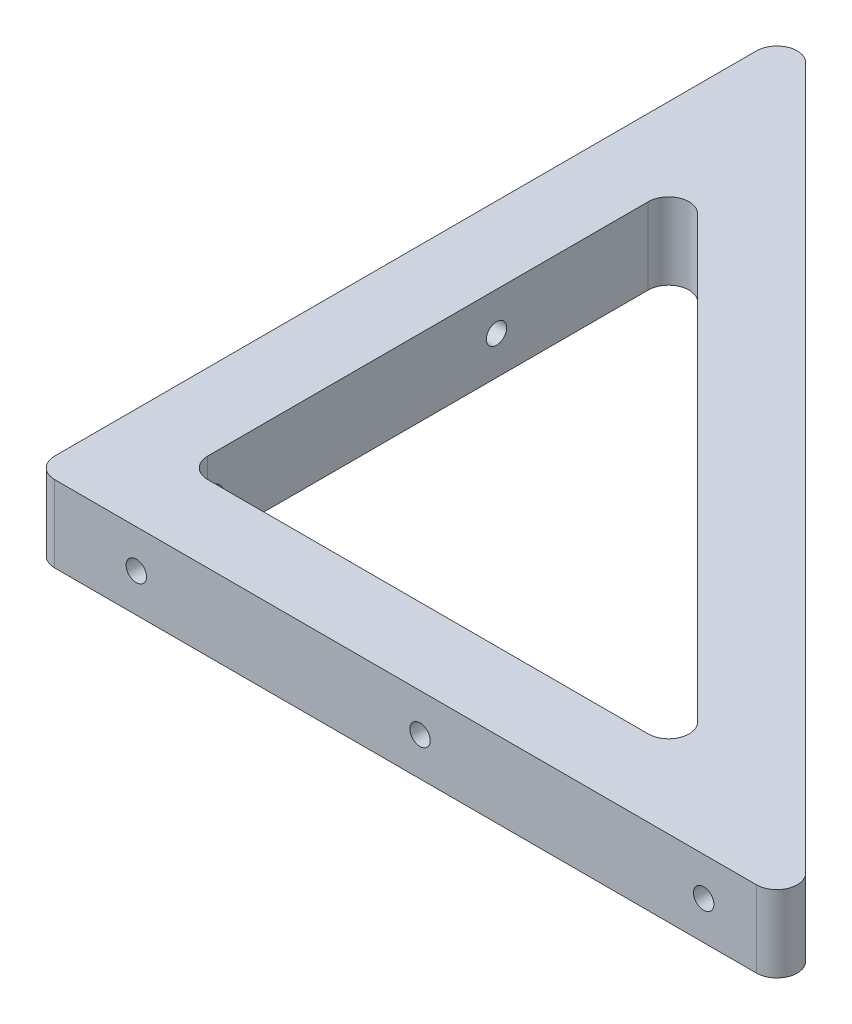
ISO-10303-21;
HEADER;
FILE_DESCRIPTION(('STEP AP214'),'2;1');
FILE_NAME('part.step','',(''),(''),'','','');
FILE_SCHEMA(('AUTOMOTIVE_DESIGN { 1 0 10303 214 1 1 1 1 }'));
ENDSEC;
DATA;
#1=APPLICATION_CONTEXT('core data for automotive mechanical design processes');
#2=APPLICATION_PROTOCOL_DEFINITION('international standard','automotive_design',2000,#1);
#3=PRODUCT_CONTEXT('',#1,'mechanical');
#4=PRODUCT('Part','Part','',(#3));
#5=PRODUCT_RELATED_PRODUCT_CATEGORY('part','',(#4));
#6=PRODUCT_DEFINITION_FORMATION('','',#4);
#7=PRODUCT_DEFINITION_CONTEXT('part definition',#1,'design');
#8=PRODUCT_DEFINITION('design','',#6,#7);
#9=PRODUCT_DEFINITION_SHAPE('','',#8);
#10=(LENGTH_UNIT() NAMED_UNIT(*) SI_UNIT(.MILLI.,.METRE.));
#11=(NAMED_UNIT(*) PLANE_ANGLE_UNIT() SI_UNIT($,.RADIAN.));
#12=(NAMED_UNIT(*) SI_UNIT($,.STERADIAN.) SOLID_ANGLE_UNIT());
#13=UNCERTAINTY_MEASURE_WITH_UNIT(LENGTH_MEASURE(1.E-05),#10,'distance_accuracy_value','');
#14=(GEOMETRIC_REPRESENTATION_CONTEXT(3) GLOBAL_UNCERTAINTY_ASSIGNED_CONTEXT((#13)) GLOBAL_UNIT_ASSIGNED_CONTEXT((#10,
#11,#12)) REPRESENTATION_CONTEXT('',''));
#15=CARTESIAN_POINT('',(0.,0.,0.));
#16=DIRECTION('',(0.,0.,1.));
#17=DIRECTION('',(1.,0.,0.));
#18=AXIS2_PLACEMENT_3D('',#15,#16,#17);
#19=CARTESIAN_POINT('',(38.4851920908019,4.7625,-38.4851920908019));
#20=DIRECTION('',(-0.707106781186548,0.,0.707106781186548));
#21=DIRECTION('',(0.707106781186548,0.,0.707106781186548));
#22=AXIS2_PLACEMENT_3D('',#19,#20,#21);
#23=PLANE('',#22);
#24=DIRECTION('',(-0.707106781186548,0.,-0.707106781186548));
#25=VECTOR('',#24,1.);
#26=CARTESIAN_POINT('',(38.4851920908019,4.7625,-38.4851920908019));
#27=LINE('',#26,#25);
#28=CARTESIAN_POINT('',(82.1593329573899,4.7625,5.18894877578618));
#29=VERTEX_POINT('',#28);
#30=CARTESIAN_POINT('',(-5.18894877578618,4.7625,-82.1593329573899));
#31=VERTEX_POINT('',#30);
#32=EDGE_CURVE('E386',#29,#31,#27,.T.);
#33=ORIENTED_EDGE('',*,*,#32,.F.);
#34=DIRECTION('',(0.,-1.,0.));
#35=VECTOR('',#34,1.);
#36=CARTESIAN_POINT('',(82.1593329573899,4.7625,5.18894877578616));
#37=LINE('',#36,#35);
#38=CARTESIAN_POINT('',(82.1593329573899,-4.7625,5.18894877578618));
#39=VERTEX_POINT('',#38);
#40=EDGE_CURVE('E192',#29,#39,#37,.T.);
#41=ORIENTED_EDGE('',*,*,#40,.T.);
#42=DIRECTION('',(-0.707106781186548,0.,-0.707106781186548));
#43=VECTOR('',#42,1.);
#44=CARTESIAN_POINT('',(38.4851920908019,-4.7625,-38.4851920908019));
#45=LINE('',#44,#43);
#46=CARTESIAN_POINT('',(-5.18894877578618,-4.7625,-82.1593329573899));
#47=VERTEX_POINT('',#46);
#48=EDGE_CURVE('E395',#39,#47,#45,.T.);
#49=ORIENTED_EDGE('',*,*,#48,.T.);
#50=DIRECTION('',(0.,-1.,0.));
#51=VECTOR('',#50,1.);
#52=CARTESIAN_POINT('',(-5.18894877578617,4.7625,-82.1593329573899));
#53=LINE('',#52,#51);
#54=EDGE_CURVE('E190',#47,#31,#53,.F.);
#55=ORIENTED_EDGE('',*,*,#54,.T.);
#56=EDGE_LOOP('',(#33,#41,#49,#55));
#57=FACE_BOUND('',#56,.T.);
#58=DIRECTION('',(0.,-1.,0.));
#59=VECTOR('',#58,1.);
#60=CARTESIAN_POINT('',(3.175,4.7625,-73.7953841816037));
#61=LINE('',#60,#59);
#62=CARTESIAN_POINT('',(3.175,1.26999999999999,-73.7953841816037));
#63=VERTEX_POINT('',#62);
#64=CARTESIAN_POINT('',(3.175,-1.26999999999999,-73.7953841816037));
#65=VERTEX_POINT('',#64);
#66=EDGE_CURVE('E183',#63,#65,#61,.T.);
#67=ORIENTED_EDGE('',*,*,#66,.F.);
#68=CARTESIAN_POINT('',(3.17499999999998,0.,-73.7953841816037));
#69=DIRECTION('',(-0.707106781186548,0.,0.707106781186548));
#70=DIRECTION('',(-0.707106781186548,0.,-0.707106781186548));
#71=AXIS2_PLACEMENT_3D('',#68,#69,#70);
#72=ELLIPSE('',#71,1.79605122421382,1.26999999999999);
#73=EDGE_CURVE('E377',#63,#65,#72,.T.);
#74=ORIENTED_EDGE('',*,*,#73,.T.);
#75=EDGE_LOOP('',(#67,#74));
#76=FACE_BOUND('',#75,.T.);
#77=CARTESIAN_POINT('',(73.7953841816037,0.,-3.17499999999999));
#78=DIRECTION('',(-0.707106781186548,0.,0.707106781186548));
#79=DIRECTION('',(0.707106781186548,0.,0.707106781186548));
#80=AXIS2_PLACEMENT_3D('',#77,#78,#79);
#81=ELLIPSE('',#80,1.79605122421382,1.26999999999999);
#82=CARTESIAN_POINT('',(73.7953841816037,1.26999999999999,-3.17499999999999));
#83=VERTEX_POINT('',#82);
#84=CARTESIAN_POINT('',(73.7953841816037,-1.26999999999999,-3.17499999999998));
#85=VERTEX_POINT('',#84);
#86=EDGE_CURVE('E182',#83,#85,#81,.F.);
#87=ORIENTED_EDGE('',*,*,#86,.F.);
#88=DIRECTION('',(0.,1.,0.));
#89=VECTOR('',#88,1.);
#90=CARTESIAN_POINT('',(73.7953841816037,4.7625,-3.17499999999998));
#91=LINE('',#90,#89);
#92=EDGE_CURVE('E175',#85,#83,#91,.T.);
#93=ORIENTED_EDGE('',*,*,#92,.F.);
#94=EDGE_LOOP('',(#87,#93));
#95=FACE_BOUND('',#94,.T.);
#96=ADVANCED_FACE('F53',(#57,#76,#95),#23,.F.);
#97=CARTESIAN_POINT('',(0.,4.7625,0.));
#98=DIRECTION('',(0.,-1.,0.));
#99=DIRECTION('',(0.,0.,-1.));
#100=AXIS2_PLACEMENT_3D('',#97,#98,#99);
#101=PLANE('',#100);
#102=DIRECTION('',(1.,0.,0.));
#103=VECTOR('',#102,1.);
#104=CARTESIAN_POINT('',(0.,4.7625,9.525));
#105=LINE('',#104,#103);
#106=CARTESIAN_POINT('',(-6.985,4.7625,9.525));
#107=VERTEX_POINT('',#106);
#108=CARTESIAN_POINT('',(80.3632817331761,4.7625,9.525));
#109=VERTEX_POINT('',#108);
#110=EDGE_CURVE('E383',#107,#109,#105,.T.);
#111=ORIENTED_EDGE('',*,*,#110,.T.);
#112=CARTESIAN_POINT('',(80.3632817331761,4.7625,6.985));
#113=DIRECTION('',(0.,-1.,0.));
#114=DIRECTION('',(0.,0.,-1.));
#115=AXIS2_PLACEMENT_3D('',#112,#113,#114);
#116=CIRCLE('',#115,2.54);
#117=EDGE_CURVE('E213',#109,#29,#116,.F.);
#118=ORIENTED_EDGE('',*,*,#117,.T.);
#119=ORIENTED_EDGE('',*,*,#32,.T.);
#120=CARTESIAN_POINT('',(-6.985,4.7625,-80.3632817331761));
#121=DIRECTION('',(0.,-1.,0.));
#122=DIRECTION('',(0.,0.,-1.));
#123=AXIS2_PLACEMENT_3D('',#120,#121,#122);
#124=CIRCLE('',#123,2.54);
#125=CARTESIAN_POINT('',(-9.525,4.7625,-80.3632817331761));
#126=VERTEX_POINT('',#125);
#127=EDGE_CURVE('E209',#31,#126,#124,.F.);
#128=ORIENTED_EDGE('',*,*,#127,.T.);
#129=DIRECTION('',(0.,0.,1.));
#130=VECTOR('',#129,1.);
#131=CARTESIAN_POINT('',(-9.525,4.7625,0.));
#132=LINE('',#131,#130);
#133=CARTESIAN_POINT('',(-9.525,4.7625,6.985));
#134=VERTEX_POINT('',#133);
#135=EDGE_CURVE('E390',#126,#134,#132,.T.);
#136=ORIENTED_EDGE('',*,*,#135,.T.);
#137=CARTESIAN_POINT('',(-6.985,4.7625,6.985));
#138=DIRECTION('',(0.,-1.,0.));
#139=DIRECTION('',(0.,0.,-1.));
#140=AXIS2_PLACEMENT_3D('',#137,#138,#139);
#141=CIRCLE('',#140,2.54);
#142=EDGE_CURVE('E211',#134,#107,#141,.F.);
#143=ORIENTED_EDGE('',*,*,#142,.T.);
#144=EDGE_LOOP('',(#111,#118,#119,#128,#136,#143));
#145=FACE_BOUND('',#144,.T.);
#146=DIRECTION('',(1.,0.,0.));
#147=VECTOR('',#146,1.);
#148=CARTESIAN_POINT('',(63.5,4.7625,0.));
#149=LINE('',#148,#147);
#150=CARTESIAN_POINT('',(2.54,4.7625,0.));
#151=VERTEX_POINT('',#150);
#152=CARTESIAN_POINT('',(57.3678975515723,4.7625,0.));
#153=VERTEX_POINT('',#152);
#154=EDGE_CURVE('E308',#151,#153,#149,.T.);
#155=ORIENTED_EDGE('',*,*,#154,.F.);
#156=CARTESIAN_POINT('',(2.54,4.7625,-2.54));
#157=DIRECTION('',(0.,-1.,0.));
#158=DIRECTION('',(0.,0.,-1.));
#159=AXIS2_PLACEMENT_3D('',#156,#157,#158);
#160=CIRCLE('',#159,2.54);
#161=CARTESIAN_POINT('',(0.,4.7625,-2.54));
#162=VERTEX_POINT('',#161);
#163=EDGE_CURVE('E252',#151,#162,#160,.T.);
#164=ORIENTED_EDGE('',*,*,#163,.T.);
#165=DIRECTION('',(0.,0.,1.));
#166=VECTOR('',#165,1.);
#167=CARTESIAN_POINT('',(0.,4.7625,0.));
#168=LINE('',#167,#166);
#169=CARTESIAN_POINT('',(0.,4.7625,-57.3678975515723));
#170=VERTEX_POINT('',#169);
#171=EDGE_CURVE('E305',#170,#162,#168,.T.);
#172=ORIENTED_EDGE('',*,*,#171,.F.);
#173=CARTESIAN_POINT('',(2.54,4.7625,-57.3678975515723));
#174=DIRECTION('',(0.,-1.,0.));
#175=DIRECTION('',(0.,0.,-1.));
#176=AXIS2_PLACEMENT_3D('',#173,#174,#175);
#177=CIRCLE('',#176,2.54);
#178=CARTESIAN_POINT('',(4.33605122421383,4.7625,-59.1639487757862));
#179=VERTEX_POINT('',#178);
#180=EDGE_CURVE('E12',#170,#179,#177,.T.);
#181=ORIENTED_EDGE('',*,*,#180,.T.);
#182=DIRECTION('',(-0.707106781186548,0.,-0.707106781186548));
#183=VECTOR('',#182,1.);
#184=CARTESIAN_POINT('',(0.,4.7625,-63.5));
#185=LINE('',#184,#183);
#186=CARTESIAN_POINT('',(59.1639487757862,4.7625,-4.33605122421382));
#187=VERTEX_POINT('',#186);
#188=EDGE_CURVE('E312',#187,#179,#185,.T.);
#189=ORIENTED_EDGE('',*,*,#188,.F.);
#190=CARTESIAN_POINT('',(57.3678975515723,4.7625,-2.54));
#191=DIRECTION('',(0.,-1.,0.));
#192=DIRECTION('',(0.,0.,-1.));
#193=AXIS2_PLACEMENT_3D('',#190,#191,#192);
#194=CIRCLE('',#193,2.54);
#195=EDGE_CURVE('E240',#187,#153,#194,.T.);
#196=ORIENTED_EDGE('',*,*,#195,.T.);
#197=EDGE_LOOP('',(#155,#164,#172,#181,#189,#196));
#198=FACE_BOUND('',#197,.T.);
#199=ADVANCED_FACE('F304',(#145,#198),#101,.F.);
#200=CARTESIAN_POINT('',(0.,-4.7625,0.));
#201=DIRECTION('',(0.,-1.,0.));
#202=DIRECTION('',(0.,0.,-1.));
#203=AXIS2_PLACEMENT_3D('',#200,#201,#202);
#204=PLANE('',#203);
#205=ORIENTED_EDGE('',*,*,#48,.F.);
#206=CARTESIAN_POINT('',(80.3632817331761,-4.7625,6.985));
#207=DIRECTION('',(0.,-1.,0.));
#208=DIRECTION('',(0.,0.,-1.));
#209=AXIS2_PLACEMENT_3D('',#206,#207,#208);
#210=CIRCLE('',#209,2.54);
#211=CARTESIAN_POINT('',(80.3632817331761,-4.7625,9.525));
#212=VERTEX_POINT('',#211);
#213=EDGE_CURVE('E202',#39,#212,#210,.T.);
#214=ORIENTED_EDGE('',*,*,#213,.T.);
#215=DIRECTION('',(1.,0.,0.));
#216=VECTOR('',#215,1.);
#217=CARTESIAN_POINT('',(0.,-4.7625,9.525));
#218=LINE('',#217,#216);
#219=CARTESIAN_POINT('',(-6.985,-4.7625,9.525));
#220=VERTEX_POINT('',#219);
#221=EDGE_CURVE('E311',#220,#212,#218,.T.);
#222=ORIENTED_EDGE('',*,*,#221,.F.);
#223=CARTESIAN_POINT('',(-6.985,-4.7625,6.985));
#224=DIRECTION('',(0.,-1.,0.));
#225=DIRECTION('',(0.,0.,-1.));
#226=AXIS2_PLACEMENT_3D('',#223,#224,#225);
#227=CIRCLE('',#226,2.54);
#228=CARTESIAN_POINT('',(-9.525,-4.7625,6.985));
#229=VERTEX_POINT('',#228);
#230=EDGE_CURVE('E200',#220,#229,#227,.T.);
#231=ORIENTED_EDGE('',*,*,#230,.T.);
#232=DIRECTION('',(0.,0.,1.));
#233=VECTOR('',#232,1.);
#234=CARTESIAN_POINT('',(-9.525,-4.7625,0.));
#235=LINE('',#234,#233);
#236=CARTESIAN_POINT('',(-9.525,-4.7625,-80.3632817331761));
#237=VERTEX_POINT('',#236);
#238=EDGE_CURVE('E387',#237,#229,#235,.T.);
#239=ORIENTED_EDGE('',*,*,#238,.F.);
#240=CARTESIAN_POINT('',(-6.985,-4.7625,-80.3632817331761));
#241=DIRECTION('',(0.,-1.,0.));
#242=DIRECTION('',(0.,0.,-1.));
#243=AXIS2_PLACEMENT_3D('',#240,#241,#242);
#244=CIRCLE('',#243,2.54);
#245=EDGE_CURVE('E198',#237,#47,#244,.T.);
#246=ORIENTED_EDGE('',*,*,#245,.T.);
#247=EDGE_LOOP('',(#205,#214,#222,#231,#239,#246));
#248=FACE_BOUND('',#247,.T.);
#249=DIRECTION('',(-0.707106781186548,0.,-0.707106781186548));
#250=VECTOR('',#249,1.);
#251=CARTESIAN_POINT('',(0.,-4.7625,-63.5));
#252=LINE('',#251,#250);
#253=CARTESIAN_POINT('',(59.1639487757862,-4.7625,-4.33605122421382));
#254=VERTEX_POINT('',#253);
#255=CARTESIAN_POINT('',(4.33605122421383,-4.7625,-59.1639487757862));
#256=VERTEX_POINT('',#255);
#257=EDGE_CURVE('E374',#254,#256,#252,.T.);
#258=ORIENTED_EDGE('',*,*,#257,.T.);
#259=CARTESIAN_POINT('',(2.54,-4.7625,-57.3678975515723));
#260=DIRECTION('',(0.,-1.,0.));
#261=DIRECTION('',(0.,0.,-1.));
#262=AXIS2_PLACEMENT_3D('',#259,#260,#261);
#263=CIRCLE('',#262,2.54);
#264=CARTESIAN_POINT('',(0.,-4.7625,-57.3678975515723));
#265=VERTEX_POINT('',#264);
#266=EDGE_CURVE('E68',#256,#265,#263,.F.);
#267=ORIENTED_EDGE('',*,*,#266,.T.);
#268=DIRECTION('',(0.,0.,1.));
#269=VECTOR('',#268,1.);
#270=CARTESIAN_POINT('',(0.,-4.7625,0.));
#271=LINE('',#270,#269);
#272=CARTESIAN_POINT('',(0.,-4.7625,-2.54));
#273=VERTEX_POINT('',#272);
#274=EDGE_CURVE('E371',#265,#273,#271,.T.);
#275=ORIENTED_EDGE('',*,*,#274,.T.);
#276=CARTESIAN_POINT('',(2.54,-4.7625,-2.54));
#277=DIRECTION('',(0.,-1.,0.));
#278=DIRECTION('',(0.,0.,-1.));
#279=AXIS2_PLACEMENT_3D('',#276,#277,#278);
#280=CIRCLE('',#279,2.54);
#281=CARTESIAN_POINT('',(2.54,-4.7625,0.));
#282=VERTEX_POINT('',#281);
#283=EDGE_CURVE('E242',#273,#282,#280,.F.);
#284=ORIENTED_EDGE('',*,*,#283,.T.);
#285=DIRECTION('',(1.,0.,0.));
#286=VECTOR('',#285,1.);
#287=CARTESIAN_POINT('',(63.5,-4.7625,0.));
#288=LINE('',#287,#286);
#289=CARTESIAN_POINT('',(57.3678975515723,-4.7625,0.));
#290=VERTEX_POINT('',#289);
#291=EDGE_CURVE('E380',#282,#290,#288,.T.);
#292=ORIENTED_EDGE('',*,*,#291,.T.);
#293=CARTESIAN_POINT('',(57.3678975515723,-4.7625,-2.54));
#294=DIRECTION('',(0.,-1.,0.));
#295=DIRECTION('',(0.,0.,-1.));
#296=AXIS2_PLACEMENT_3D('',#293,#294,#295);
#297=CIRCLE('',#296,2.54);
#298=EDGE_CURVE('E238',#290,#254,#297,.F.);
#299=ORIENTED_EDGE('',*,*,#298,.T.);
#300=EDGE_LOOP('',(#258,#267,#275,#284,#292,#299));
#301=FACE_BOUND('',#300,.T.);
#302=ADVANCED_FACE('F330',(#248,#301),#204,.T.);
#303=CARTESIAN_POINT('',(0.,4.7625,9.525));
#304=DIRECTION('',(0.,0.,-1.));
#305=DIRECTION('',(-1.,0.,0.));
#306=AXIS2_PLACEMENT_3D('',#303,#304,#305);
#307=PLANE('',#306);
#308=CARTESIAN_POINT('',(3.175,0.,9.525));
#309=DIRECTION('',(0.,0.,-1.));
#310=DIRECTION('',(-1.,0.,0.));
#311=AXIS2_PLACEMENT_3D('',#308,#309,#310);
#312=CIRCLE('',#311,1.27);
#313=CARTESIAN_POINT('',(1.905,0.,9.525));
#314=VERTEX_POINT('',#313);
#315=EDGE_CURVE('E410',#314,#314,#312,.T.);
#316=ORIENTED_EDGE('',*,*,#315,.T.);
#317=EDGE_LOOP('',(#316));
#318=FACE_BOUND('',#317,.T.);
#319=CARTESIAN_POINT('',(38.4851920908019,0.,9.52500000000001));
#320=DIRECTION('',(0.,0.,-1.));
#321=DIRECTION('',(-1.,0.,0.));
#322=AXIS2_PLACEMENT_3D('',#319,#320,#321);
#323=CIRCLE('',#322,1.27);
#324=CARTESIAN_POINT('',(37.2151920908019,0.,9.52500000000001));
#325=VERTEX_POINT('',#324);
#326=EDGE_CURVE('E187',#325,#325,#323,.T.);
#327=ORIENTED_EDGE('',*,*,#326,.T.);
#328=EDGE_LOOP('',(#327));
#329=FACE_BOUND('',#328,.T.);
#330=CARTESIAN_POINT('',(73.7953841816037,0.,9.52500000000001));
#331=DIRECTION('',(0.,0.,-1.));
#332=DIRECTION('',(-1.,0.,0.));
#333=AXIS2_PLACEMENT_3D('',#330,#331,#332);
#334=CIRCLE('',#333,1.26999999999999);
#335=CARTESIAN_POINT('',(72.5253841816037,0.,9.52500000000001));
#336=VERTEX_POINT('',#335);
#337=EDGE_CURVE('E188',#336,#336,#334,.T.);
#338=ORIENTED_EDGE('',*,*,#337,.T.);
#339=EDGE_LOOP('',(#338));
#340=FACE_BOUND('',#339,.T.);
#341=ORIENTED_EDGE('',*,*,#221,.T.);
#342=DIRECTION('',(0.,-1.,0.));
#343=VECTOR('',#342,1.);
#344=CARTESIAN_POINT('',(80.3632817331761,4.7625,9.525));
#345=LINE('',#344,#343);
#346=EDGE_CURVE('E207',#212,#109,#345,.F.);
#347=ORIENTED_EDGE('',*,*,#346,.T.);
#348=ORIENTED_EDGE('',*,*,#110,.F.);
#349=DIRECTION('',(0.,-1.,0.));
#350=VECTOR('',#349,1.);
#351=CARTESIAN_POINT('',(-6.985,4.7625,9.525));
#352=LINE('',#351,#350);
#353=EDGE_CURVE('E204',#107,#220,#352,.T.);
#354=ORIENTED_EDGE('',*,*,#353,.T.);
#355=EDGE_LOOP('',(#341,#347,#348,#354));
#356=FACE_BOUND('',#355,.T.);
#357=ADVANCED_FACE('F339',(#318,#329,#340,#356),#307,.F.);
#358=CARTESIAN_POINT('',(-9.525,4.7625,0.));
#359=DIRECTION('',(1.,0.,0.));
#360=DIRECTION('',(0.,0.,-1.));
#361=AXIS2_PLACEMENT_3D('',#358,#359,#360);
#362=PLANE('',#361);
#363=CARTESIAN_POINT('',(-9.525,0.,-3.175));
#364=DIRECTION('',(-1.,0.,0.));
#365=DIRECTION('',(0.,0.,1.));
#366=AXIS2_PLACEMENT_3D('',#363,#364,#365);
#367=CIRCLE('',#366,1.27);
#368=CARTESIAN_POINT('',(-9.525,0.,-1.905));
#369=VERTEX_POINT('',#368);
#370=EDGE_CURVE('E403',#369,#369,#367,.T.);
#371=ORIENTED_EDGE('',*,*,#370,.F.);
#372=EDGE_LOOP('',(#371));
#373=FACE_BOUND('',#372,.T.);
#374=CARTESIAN_POINT('',(-9.525,0.,-38.4851920908019));
#375=DIRECTION('',(-1.,0.,0.));
#376=DIRECTION('',(0.,0.,1.));
#377=AXIS2_PLACEMENT_3D('',#374,#375,#376);
#378=CIRCLE('',#377,1.27);
#379=CARTESIAN_POINT('',(-9.525,0.,-37.2151920908019));
#380=VERTEX_POINT('',#379);
#381=EDGE_CURVE('E417',#380,#380,#378,.T.);
#382=ORIENTED_EDGE('',*,*,#381,.F.);
#383=EDGE_LOOP('',(#382));
#384=FACE_BOUND('',#383,.T.);
#385=CARTESIAN_POINT('',(-9.525,0.,-73.7953841816037));
#386=DIRECTION('',(-1.,0.,0.));
#387=DIRECTION('',(0.,0.,1.));
#388=AXIS2_PLACEMENT_3D('',#385,#386,#387);
#389=CIRCLE('',#388,1.26999999999999);
#390=CARTESIAN_POINT('',(-9.525,0.,-72.5253841816037));
#391=VERTEX_POINT('',#390);
#392=EDGE_CURVE('E411',#391,#391,#389,.T.);
#393=ORIENTED_EDGE('',*,*,#392,.F.);
#394=EDGE_LOOP('',(#393));
#395=FACE_BOUND('',#394,.T.);
#396=ORIENTED_EDGE('',*,*,#238,.T.);
#397=DIRECTION('',(0.,-1.,0.));
#398=VECTOR('',#397,1.);
#399=CARTESIAN_POINT('',(-9.525,4.7625,6.985));
#400=LINE('',#399,#398);
#401=EDGE_CURVE('E218',#229,#134,#400,.F.);
#402=ORIENTED_EDGE('',*,*,#401,.T.);
#403=ORIENTED_EDGE('',*,*,#135,.F.);
#404=DIRECTION('',(0.,-1.,0.));
#405=VECTOR('',#404,1.);
#406=CARTESIAN_POINT('',(-9.525,4.7625,-80.3632817331761));
#407=LINE('',#406,#405);
#408=EDGE_CURVE('E215',#126,#237,#407,.T.);
#409=ORIENTED_EDGE('',*,*,#408,.T.);
#410=EDGE_LOOP('',(#396,#402,#403,#409));
#411=FACE_BOUND('',#410,.T.);
#412=ADVANCED_FACE('F337',(#373,#384,#395,#411),#362,.F.);
#413=CARTESIAN_POINT('',(63.5,4.7625,0.));
#414=DIRECTION('',(0.,0.,-1.));
#415=DIRECTION('',(-1.,0.,0.));
#416=AXIS2_PLACEMENT_3D('',#413,#414,#415);
#417=PLANE('',#416);
#418=ORIENTED_EDGE('',*,*,#154,.T.);
#419=DIRECTION('',(0.,-1.,0.));
#420=VECTOR('',#419,1.);
#421=CARTESIAN_POINT('',(57.3678975515723,-4.7625,0.));
#422=LINE('',#421,#420);
#423=EDGE_CURVE('E224',#153,#290,#422,.T.);
#424=ORIENTED_EDGE('',*,*,#423,.T.);
#425=ORIENTED_EDGE('',*,*,#291,.F.);
#426=DIRECTION('',(0.,-1.,0.));
#427=VECTOR('',#426,1.);
#428=CARTESIAN_POINT('',(2.54,4.7625,0.));
#429=LINE('',#428,#427);
#430=CARTESIAN_POINT('',(2.54,-1.09985226280624,0.));
#431=VERTEX_POINT('',#430);
#432=EDGE_CURVE('E222',#282,#431,#429,.F.);
#433=ORIENTED_EDGE('',*,*,#432,.T.);
#434=CARTESIAN_POINT('',(3.175,0.,0.));
#435=DIRECTION('',(0.,0.,-1.));
#436=DIRECTION('',(-1.,0.,0.));
#437=AXIS2_PLACEMENT_3D('',#434,#435,#436);
#438=CIRCLE('',#437,1.27);
#439=CARTESIAN_POINT('',(2.54,1.09985226280624,0.));
#440=VERTEX_POINT('',#439);
#441=EDGE_CURVE('E409',#431,#440,#438,.F.);
#442=ORIENTED_EDGE('',*,*,#441,.T.);
#443=DIRECTION('',(0.,-1.,0.));
#444=VECTOR('',#443,1.);
#445=CARTESIAN_POINT('',(2.54,4.7625,0.));
#446=LINE('',#445,#444);
#447=EDGE_CURVE('E220',#440,#151,#446,.F.);
#448=ORIENTED_EDGE('',*,*,#447,.T.);
#449=EDGE_LOOP('',(#418,#424,#425,#433,#442,#448));
#450=FACE_BOUND('',#449,.T.);
#451=CARTESIAN_POINT('',(38.4851920908019,0.,0.));
#452=DIRECTION('',(0.,0.,-1.));
#453=DIRECTION('',(-1.,0.,0.));
#454=AXIS2_PLACEMENT_3D('',#451,#452,#453);
#455=CIRCLE('',#454,1.27);
#456=CARTESIAN_POINT('',(37.2151920908019,0.,0.));
#457=VERTEX_POINT('',#456);
#458=EDGE_CURVE('E407',#457,#457,#455,.F.);
#459=ORIENTED_EDGE('',*,*,#458,.T.);
#460=EDGE_LOOP('',(#459));
#461=FACE_BOUND('',#460,.T.);
#462=ADVANCED_FACE('F366',(#450,#461),#417,.T.);
#463=CARTESIAN_POINT('',(0.,4.7625,-63.5));
#464=DIRECTION('',(-0.707106781186548,0.,0.707106781186548));
#465=DIRECTION('',(0.707106781186548,0.,0.707106781186548));
#466=AXIS2_PLACEMENT_3D('',#463,#464,#465);
#467=PLANE('',#466);
#468=ORIENTED_EDGE('',*,*,#257,.F.);
#469=DIRECTION('',(0.,-1.,0.));
#470=VECTOR('',#469,1.);
#471=CARTESIAN_POINT('',(59.1639487757862,4.7625,-4.33605122421384));
#472=LINE('',#471,#470);
#473=EDGE_CURVE('E230',#254,#187,#472,.F.);
#474=ORIENTED_EDGE('',*,*,#473,.T.);
#475=ORIENTED_EDGE('',*,*,#188,.T.);
#476=DIRECTION('',(0.,-1.,0.));
#477=VECTOR('',#476,1.);
#478=CARTESIAN_POINT('',(4.33605122421383,-4.7625,-59.1639487757862));
#479=LINE('',#478,#477);
#480=EDGE_CURVE('E227',#179,#256,#479,.T.);
#481=ORIENTED_EDGE('',*,*,#480,.T.);
#482=EDGE_LOOP('',(#468,#474,#475,#481));
#483=FACE_BOUND('',#482,.T.);
#484=ADVANCED_FACE('F455',(#483),#467,.T.);
#485=CARTESIAN_POINT('',(0.,4.7625,0.));
#486=DIRECTION('',(1.,0.,0.));
#487=DIRECTION('',(0.,0.,-1.));
#488=AXIS2_PLACEMENT_3D('',#485,#486,#487);
#489=PLANE('',#488);
#490=ORIENTED_EDGE('',*,*,#171,.T.);
#491=DIRECTION('',(0.,-1.,0.));
#492=VECTOR('',#491,1.);
#493=CARTESIAN_POINT('',(0.,-4.7625,-2.54));
#494=LINE('',#493,#492);
#495=CARTESIAN_POINT('',(0.,1.09985226280624,-2.54));
#496=VERTEX_POINT('',#495);
#497=EDGE_CURVE('E236',#162,#496,#494,.T.);
#498=ORIENTED_EDGE('',*,*,#497,.T.);
#499=CARTESIAN_POINT('',(0.,0.,-3.175));
#500=DIRECTION('',(1.,0.,0.));
#501=DIRECTION('',(0.,0.,-1.));
#502=AXIS2_PLACEMENT_3D('',#499,#500,#501);
#503=CIRCLE('',#502,1.27);
#504=CARTESIAN_POINT('',(0.,-1.09985226280624,-2.54));
#505=VERTEX_POINT('',#504);
#506=EDGE_CURVE('E76',#505,#496,#503,.T.);
#507=ORIENTED_EDGE('',*,*,#506,.F.);
#508=DIRECTION('',(0.,-1.,0.));
#509=VECTOR('',#508,1.);
#510=CARTESIAN_POINT('',(0.,-4.7625,-2.54));
#511=LINE('',#510,#509);
#512=EDGE_CURVE('E234',#505,#273,#511,.T.);
#513=ORIENTED_EDGE('',*,*,#512,.T.);
#514=ORIENTED_EDGE('',*,*,#274,.F.);
#515=DIRECTION('',(0.,-1.,0.));
#516=VECTOR('',#515,1.);
#517=CARTESIAN_POINT('',(0.,4.7625,-57.3678975515723));
#518=LINE('',#517,#516);
#519=EDGE_CURVE('E232',#265,#170,#518,.F.);
#520=ORIENTED_EDGE('',*,*,#519,.T.);
#521=EDGE_LOOP('',(#490,#498,#507,#513,#514,#520));
#522=FACE_BOUND('',#521,.T.);
#523=CARTESIAN_POINT('',(0.,0.,-38.4851920908019));
#524=DIRECTION('',(1.,0.,0.));
#525=DIRECTION('',(0.,0.,-1.));
#526=AXIS2_PLACEMENT_3D('',#523,#524,#525);
#527=CIRCLE('',#526,1.27);
#528=CARTESIAN_POINT('',(0.,0.,-39.7551920908019));
#529=VERTEX_POINT('',#528);
#530=EDGE_CURVE('E400',#529,#529,#527,.T.);
#531=ORIENTED_EDGE('',*,*,#530,.F.);
#532=EDGE_LOOP('',(#531));
#533=FACE_BOUND('',#532,.T.);
#534=ADVANCED_FACE('F286',(#522,#533),#489,.T.);
#535=CARTESIAN_POINT('',(3.175,0.,-38.4851920908019));
#536=DIRECTION('',(-1.,0.,0.));
#537=DIRECTION('',(0.,0.,1.));
#538=AXIS2_PLACEMENT_3D('',#535,#536,#537);
#539=CYLINDRICAL_SURFACE('',#538,1.27);
#540=ORIENTED_EDGE('',*,*,#530,.T.);
#541=EDGE_LOOP('',(#540));
#542=FACE_BOUND('',#541,.T.);
#543=ORIENTED_EDGE('',*,*,#381,.T.);
#544=EDGE_LOOP('',(#543));
#545=FACE_BOUND('',#544,.T.);
#546=ADVANCED_FACE('F280',(#542,#545),#539,.F.);
#547=CARTESIAN_POINT('',(3.175,0.,-3.175));
#548=DIRECTION('',(-1.,0.,0.));
#549=DIRECTION('',(0.,0.,1.));
#550=AXIS2_PLACEMENT_3D('',#547,#548,#549);
#551=CYLINDRICAL_SURFACE('',#550,1.27);
#552=EDGE_CURVE('E404',#496,#505,#503,.T.);
#553=ORIENTED_EDGE('',*,*,#552,.T.);
#554=ORIENTED_EDGE('',*,*,#506,.T.);
#555=EDGE_LOOP('',(#553,#554));
#556=FACE_BOUND('',#555,.T.);
#557=ORIENTED_EDGE('',*,*,#370,.T.);
#558=EDGE_LOOP('',(#557));
#559=FACE_BOUND('',#558,.T.);
#560=ADVANCED_FACE('F275',(#556,#559),#551,.F.);
#561=CARTESIAN_POINT('',(3.175,0.,-73.7953841816037));
#562=DIRECTION('',(-1.,0.,0.));
#563=DIRECTION('',(0.,0.,1.));
#564=AXIS2_PLACEMENT_3D('',#561,#562,#563);
#565=PLANE('',#564);
#566=ORIENTED_EDGE('',*,*,#66,.T.);
#567=CARTESIAN_POINT('',(3.175,0.,-73.7953841816037));
#568=DIRECTION('',(-1.,0.,0.));
#569=DIRECTION('',(0.,0.,1.));
#570=AXIS2_PLACEMENT_3D('',#567,#568,#569);
#571=CIRCLE('',#570,1.26999999999999);
#572=EDGE_CURVE('E414',#65,#63,#571,.T.);
#573=ORIENTED_EDGE('',*,*,#572,.T.);
#574=EDGE_LOOP('',(#566,#573));
#575=FACE_BOUND('',#574,.T.);
#576=ADVANCED_FACE('F279',(#575),#565,.T.);
#577=CARTESIAN_POINT('',(3.175,0.,-73.7953841816037));
#578=DIRECTION('',(-1.,0.,0.));
#579=DIRECTION('',(0.,0.,1.));
#580=AXIS2_PLACEMENT_3D('',#577,#578,#579);
#581=CYLINDRICAL_SURFACE('',#580,1.26999999999999);
#582=ORIENTED_EDGE('',*,*,#392,.T.);
#583=EDGE_LOOP('',(#582));
#584=FACE_BOUND('',#583,.T.);
#585=ORIENTED_EDGE('',*,*,#572,.F.);
#586=ORIENTED_EDGE('',*,*,#73,.F.);
#587=EDGE_LOOP('',(#585,#586));
#588=FACE_BOUND('',#587,.T.);
#589=ADVANCED_FACE('F267',(#584,#588),#581,.F.);
#590=CARTESIAN_POINT('',(38.4851920908019,0.,-3.17499999999999));
#591=DIRECTION('',(0.,0.,1.));
#592=DIRECTION('',(1.,0.,0.));
#593=AXIS2_PLACEMENT_3D('',#590,#591,#592);
#594=CYLINDRICAL_SURFACE('',#593,1.27);
#595=ORIENTED_EDGE('',*,*,#458,.F.);
#596=EDGE_LOOP('',(#595));
#597=FACE_BOUND('',#596,.T.);
#598=ORIENTED_EDGE('',*,*,#326,.F.);
#599=EDGE_LOOP('',(#598));
#600=FACE_BOUND('',#599,.T.);
#601=ADVANCED_FACE('F263',(#597,#600),#594,.F.);
#602=CARTESIAN_POINT('',(3.175,0.,-3.175));
#603=DIRECTION('',(0.,0.,1.));
#604=DIRECTION('',(1.,0.,0.));
#605=AXIS2_PLACEMENT_3D('',#602,#603,#604);
#606=CYLINDRICAL_SURFACE('',#605,1.27);
#607=ORIENTED_EDGE('',*,*,#441,.F.);
#608=CARTESIAN_POINT('',(2.46048143639282,-1.7913623949958,0.));
#609=CARTESIAN_POINT('',(-0.222545671106607,-1.14326177315515,0.));
#610=CARTESIAN_POINT('',(0.,-1.19701895936806,-2.75068218171586));
#611=CARTESIAN_POINT('',(2.4691613760457,-1.75543120037683,0.));
#612=CARTESIAN_POINT('',(-0.214632806124763,-1.14568381766003,0.));
#613=CARTESIAN_POINT('',(0.,-1.19433557184581,-2.74311839657063));
#614=CARTESIAN_POINT('',(2.47710735552602,-1.71932750759809,0.));
#615=CARTESIAN_POINT('',(-0.20616191001472,-1.14763131210998,0.));
#616=CARTESIAN_POINT('',(0.,-1.19143168836729,-2.73514555917892));
#617=CARTESIAN_POINT('',(2.49154672276952,-1.64683447825471,0.));
#618=CARTESIAN_POINT('',(-0.188048199342252,-1.15033666037947,0.));
#619=CARTESIAN_POINT('',(0.,-1.1850549285493,-2.71824339941205));
#620=CARTESIAN_POINT('',(2.49804025955999,-1.61044517139233,0.));
#621=CARTESIAN_POINT('',(-0.178413198287884,-1.15109836905029,0.));
#622=CARTESIAN_POINT('',(0.,-1.18158211064851,-2.70931417530571));
#623=CARTESIAN_POINT('',(2.51536343223653,-1.50095329976839,0.));
#624=CARTESIAN_POINT('',(-0.147724785442781,-1.15126962624411,0.));
#625=CARTESIAN_POINT('',(0.,-1.17012020191499,-2.68088886305336));
#626=CARTESIAN_POINT('',(2.52404192698463,-1.42750053897126,0.));
#627=CARTESIAN_POINT('',(-0.124816845792983,-1.14860219794341,0.));
#628=CARTESIAN_POINT('',(0.,-1.16108588872944,-2.65974982967358));
#629=CARTESIAN_POINT('',(2.53586898824071,-1.2808524464482,0.));
#630=CARTESIAN_POINT('',(-0.0737749276630715,-1.13516135172397,0.));
#631=CARTESIAN_POINT('',(0.,-1.13862984675329,-2.61186825789043));
#632=CARTESIAN_POINT('',(2.53906781794283,-1.20766098839307,0.));
#633=CARTESIAN_POINT('',(-0.0458009393782882,-1.12455585805634,0.));
#634=CARTESIAN_POINT('',(0.,-1.12524935064875,-2.58517919754123));
#635=CARTESIAN_POINT('',(2.54057563419759,-1.06127482923519,0.));
#636=CARTESIAN_POINT('',(0.0158630794714909,-1.09175321425869,0.));
#637=CARTESIAN_POINT('',(0.,-1.09116743098492,-2.52421747969062));
#638=CARTESIAN_POINT('',(2.53888709324944,-0.988080148498175,0.));
#639=CARTESIAN_POINT('',(0.0493966985497166,-1.06974539921331,0.));
#640=CARTESIAN_POINT('',(0.,-1.07046971382634,-2.489948664855));
#641=CARTESIAN_POINT('',(2.53306092931584,-0.872920136114479,0.));
#642=CARTESIAN_POINT('',(0.106675087263236,-1.02152333862325,0.));
#643=CARTESIAN_POINT('',(0.,-1.02775389699483,-2.42844380964392));
#644=CARTESIAN_POINT('',(2.53026591645811,-0.830877296347221,0.));
#645=CARTESIAN_POINT('',(0.128383613568039,-1.00123017303857,0.));
#646=CARTESIAN_POINT('',(0.,-1.01001970579244,-2.40439021764257));
#647=CARTESIAN_POINT('',(2.52360166054677,-0.746876912714693,0.));
#648=CARTESIAN_POINT('',(0.173249744768698,-0.953681951838081,0.));
#649=CARTESIAN_POINT('',(0.,-0.968608552316591,-2.35292958328545));
#650=CARTESIAN_POINT('',(2.51973240334306,-0.704919369980302,0.));
#651=CARTESIAN_POINT('',(0.196369151700677,-0.926518490564526,0.));
#652=CARTESIAN_POINT('',(0.,-0.94493151176354,-2.32552249675967));
#653=CARTESIAN_POINT('',(2.51125626721202,-0.621036993237351,0.));
#654=CARTESIAN_POINT('',(0.243436952830895,-0.863680763280281,0.));
#655=CARTESIAN_POINT('',(0.,-0.889407865103668,-2.26754863279909));
#656=CARTESIAN_POINT('',(2.5066486153668,-0.579112240275738,0.));
#657=CARTESIAN_POINT('',(0.267355727456358,-0.828114689456972,0.));
#658=CARTESIAN_POINT('',(0.,-0.857552677215937,-2.23697855650483));
#659=CARTESIAN_POINT('',(2.49716529755258,-0.495291545772859,0.));
#660=CARTESIAN_POINT('',(0.314791442695287,-0.746945797674846,0.));
#661=CARTESIAN_POINT('',(0.,-0.782952325100334,-2.17386097095943));
#662=CARTESIAN_POINT('',(2.49228961326815,-0.453395606399065,0.));
#663=CARTESIAN_POINT('',(0.33830095711003,-0.701471411616405,0.));
#664=CARTESIAN_POINT('',(0.,-0.740206415950688,-2.14131332655931));
#665=CARTESIAN_POINT('',(2.48284564532183,-0.369228696397699,0.));
#666=CARTESIAN_POINT('',(0.383086474468728,-0.598986884763984,0.));
#667=CARTESIAN_POINT('',(0.,-0.64066865488285,-2.07683680581151));
#668=CARTESIAN_POINT('',(2.4782801147538,-0.326957393034628,0.));
#669=CARTESIAN_POINT('',(0.404382179785488,-0.541980292979094,0.));
#670=CARTESIAN_POINT('',(0.,-0.58376780105212,-2.0449149090199));
#671=CARTESIAN_POINT('',(2.472255162657,-0.263471339288469,0.));
#672=CARTESIAN_POINT('',(0.432360827550384,-0.44820002629581,0.));
#673=CARTESIAN_POINT('',(0.,-0.487317868358084,-2.00168999098511));
#674=CARTESIAN_POINT('',(2.47038410001961,-0.242296585516369,0.));
#675=CARTESIAN_POINT('',(0.44101042308365,-0.415666725267421,0.));
#676=CARTESIAN_POINT('',(0.,-0.45331894925291,-1.98805824446587));
#677=CARTESIAN_POINT('',(2.46701064888602,-0.199917418269223,0.));
#678=CARTESIAN_POINT('',(0.456571914100716,-0.34825850569468,0.));
#679=CARTESIAN_POINT('',(0.,-0.381923518608194,-1.96319833034653));
#680=CARTESIAN_POINT('',(2.46550825762953,-0.178713005017436,0.));
#681=CARTESIAN_POINT('',(0.463496940920751,-0.313366143813936,0.));
#682=CARTESIAN_POINT('',(0.,-0.344527032509468,-1.95197014475079));
#683=CARTESIAN_POINT('',(2.46295740949794,-0.136304793572118,0.));
#684=CARTESIAN_POINT('',(0.475238778065983,-0.24177449624862,0.));
#685=CARTESIAN_POINT('',(0.,-0.266977459496145,-1.93273833767036));
#686=CARTESIAN_POINT('',(2.46190834848328,-0.115101032450002,0.));
#687=CARTESIAN_POINT('',(0.480070832087726,-0.205046545226099,0.));
#688=CARTESIAN_POINT('',(0.,-0.226828124465516,-1.92473042561863));
#689=CARTESIAN_POINT('',(2.46032470262201,-0.0726739799483668,0.));
#690=CARTESIAN_POINT('',(0.487356114567412,-0.13042412500702,0.));
#691=CARTESIAN_POINT('',(0.,-0.144683068506146,-1.9125858629875));
#692=CARTESIAN_POINT('',(2.45979011617649,-0.05145068862975,0.));
#693=CARTESIAN_POINT('',(0.489818384249672,-0.0924860908078279,0.));
#694=CARTESIAN_POINT('',(0.,-0.102687353316139,-1.90844920037676));
#695=CARTESIAN_POINT('',(2.45926980976471,-0.00900331748258644,0.));
#696=CARTESIAN_POINT('',(0.492211677723952,-0.0162677303220085,0.));
#697=CARTESIAN_POINT('',(0.,-0.0180839073771343,-1.90442362431816));
#698=CARTESIAN_POINT('',(2.45928393162398,0.0122207603550772,0.));
#699=CARTESIAN_POINT('',(0.492146634822505,0.022063217812496,0.));
#700=CARTESIAN_POINT('',(0.,0.0245236434596119,-1.90453348673743));
#701=CARTESIAN_POINT('',(2.4598589786725,0.0546609724386201,0.));
#702=CARTESIAN_POINT('',(0.489501528316214,0.0982320620074938,0.));
#703=CARTESIAN_POINT('',(0.,0.109054719336326,-1.90898138204478));
#704=CARTESIAN_POINT('',(2.46041989789932,0.0758771067685938,0.));
#705=CARTESIAN_POINT('',(0.486917963427999,0.136120420548667,0.));
#706=CARTESIAN_POINT('',(0.,0.150978251829946,-1.91331936882826));
#707=CARTESIAN_POINT('',(2.46258650177792,0.132054982338743,0.));
#708=CARTESIAN_POINT('',(0.476944402689164,0.23481746858426,0.));
#709=CARTESIAN_POINT('',(0.,0.259481278028586,-1.92992453064964));
#710=CARTESIAN_POINT('',(2.46463401468131,0.166999830522088,0.));
#711=CARTESIAN_POINT('',(0.467498346011794,0.294590064753288,0.));
#712=CARTESIAN_POINT('',(0.,0.324400944871398,-1.9455108401823));
#713=CARTESIAN_POINT('',(2.46980735795061,0.236809897575919,0.));
#714=CARTESIAN_POINT('',(0.44365874717001,0.40785063231124,0.));
#715=CARTESIAN_POINT('',(0.,0.445249674987669,-1.9839028805687));
#716=CARTESIAN_POINT('',(2.47293335030777,0.271675103691523,0.));
#717=CARTESIAN_POINT('',(0.429205274391407,0.461433974293034,0.));
#718=CARTESIAN_POINT('',(0.,0.501177385787949,-2.0067096959243));
#719=CARTESIAN_POINT('',(2.47984384154353,0.341371709381081,0.));
#720=CARTESIAN_POINT('',(0.397103704436708,0.561195674285125,0.));
#721=CARTESIAN_POINT('',(0.,0.60300251975596,-2.05584920937657));
#722=CARTESIAN_POINT('',(2.48362897356188,0.37620304377262,0.));
#723=CARTESIAN_POINT('',(0.379406502669744,0.607368741246094,0.));
#724=CARTESIAN_POINT('',(0.,0.648890202416763,-2.08218529187076));
#725=CARTESIAN_POINT('',(2.49144063608551,0.445836168646812,0.));
#726=CARTESIAN_POINT('',(0.342368944922615,0.692201735851231,0.));
#727=CARTESIAN_POINT('',(0.,0.731292898808419,-2.13551674429562));
#728=CARTESIAN_POINT('',(2.49546715636449,0.480637960317769,0.));
#729=CARTESIAN_POINT('',(0.3230072899462,0.730808802546927,0.));
#730=CARTESIAN_POINT('',(0.,0.767808309245222,-2.16251208626843));
#731=CARTESIAN_POINT('',(2.50341003834776,0.550309526037547,0.));
#732=CARTESIAN_POINT('',(0.283759093258311,0.801156796709766,0.));
#733=CARTESIAN_POINT('',(0.,0.833029283618055,-2.21545368339124));
#734=CARTESIAN_POINT('',(2.50732621844694,0.585179321458863,0.));
#735=CARTESIAN_POINT('',(0.263872439037812,0.832813378611192,0.));
#736=CARTESIAN_POINT('',(0.,0.8617225779897,-2.24139823665039));
#737=CARTESIAN_POINT('',(2.51475234775045,0.654962883877808,0.));
#738=CARTESIAN_POINT('',(0.224378847149944,0.890026849683488,0.));
#739=CARTESIAN_POINT('',(0.,0.912839330162893,-2.29131531533118));
#740=CARTESIAN_POINT('',(2.51826229884516,0.689876650670054,0.));
#741=CARTESIAN_POINT('',(0.204786002265829,0.915512392683296,0.));
#742=CARTESIAN_POINT('',(0.,0.935262817141499,-2.3152878499294));
#743=CARTESIAN_POINT('',(2.52464758925276,0.759744354729444,0.));
#744=CARTESIAN_POINT('',(0.166373813526404,0.961253088196936,0.));
#745=CARTESIAN_POINT('',(0.,0.975248606802939,-2.36093017508177));
#746=CARTESIAN_POINT('',(2.52752327766798,0.794698259200828,0.));
#747=CARTESIAN_POINT('',(0.147574498327821,0.981450646305873,0.));
#748=CARTESIAN_POINT('',(0.,0.992813585000439,-2.38260122896296));
#749=CARTESIAN_POINT('',(2.53246972678053,0.86466270836654,0.));
#750=CARTESIAN_POINT('',(0.111014085313804,1.01743560315424,0.));
#751=CARTESIAN_POINT('',(0.,1.0242234894009,-2.42364962028371));
#752=CARTESIAN_POINT('',(2.53454048515674,0.899673253223905,0.));
#753=CARTESIAN_POINT('',(0.0932751701092806,1.03317498397059,0.));
#754=CARTESIAN_POINT('',(0.,1.03806840487659,-2.44302695110894));
#755=CARTESIAN_POINT('',(2.53936455252391,1.00540948963379,0.));
#756=CARTESIAN_POINT('',(0.041351198329934,1.07529257534414,0.));
#757=CARTESIAN_POINT('',(0.,1.07562024160317,-2.49826193517788));
#758=CARTESIAN_POINT('',(2.54066682677466,1.0762119928871,0.));
#759=CARTESIAN_POINT('',(0.00930990751990391,1.09566807112178,0.));
#760=CARTESIAN_POINT('',(0.,1.09501941286805,-2.53081604846349));
#761=CARTESIAN_POINT('',(2.53867026332811,1.21776421793049,0.));
#762=CARTESIAN_POINT('',(-0.0497068458793286,1.12612065654,0.));
#763=CARTESIAN_POINT('',(0.,1.12715994923401,-2.58893240102266));
#764=CARTESIAN_POINT('',(2.53537111555977,1.28851393584213,0.));
#765=CARTESIAN_POINT('',(-0.0765458170988118,1.136037205008,0.));
#766=CARTESIAN_POINT('',(0.,1.13990086558293,-2.61449416897177));
#767=CARTESIAN_POINT('',(2.52362682597665,1.43101483914349,0.));
#768=CARTESIAN_POINT('',(-0.125908272568251,1.14872780468748,0.));
#769=CARTESIAN_POINT('',(0.,1.16151683219112,-2.6607608517353));
#770=CARTESIAN_POINT('',(2.51508100562243,1.50275808768503,0.));
#771=CARTESIAN_POINT('',(-0.148230316720271,1.1512694296784,0.));
#772=CARTESIAN_POINT('',(0.,1.17031027254254,-2.68135948452729));
#773=CARTESIAN_POINT('',(2.49814976435202,1.60974314092405,0.));
#774=CARTESIAN_POINT('',(-0.178213922778254,1.15109816974203,0.));
#775=CARTESIAN_POINT('',(0.,1.18150805905064,-2.70913088136774));
#776=CARTESIAN_POINT('',(2.49181605056929,1.64531895994297,0.));
#777=CARTESIAN_POINT('',(-0.187645277788195,1.1503675271081,0.));
#778=CARTESIAN_POINT('',(0.,1.18490989446136,-2.71787080816951));
#779=CARTESIAN_POINT('',(2.47776102408043,1.71619876537244,0.));
#780=CARTESIAN_POINT('',(-0.205401551232446,1.14777234266054,0.));
#781=CARTESIAN_POINT('',(0.,1.1911674194161,-2.73443403285848));
#782=CARTESIAN_POINT('',(2.47003958011738,1.75150272573986,0.));
#783=CARTESIAN_POINT('',(-0.213719145862983,1.14590417371245,0.));
#784=CARTESIAN_POINT('',(0.,1.19402305724586,-2.74225724392342));
#785=CARTESIAN_POINT('',(2.46161695319686,1.78664312721371,0.));
#786=CARTESIAN_POINT('',(-0.221501892756984,1.14357816571626,0.));
#787=CARTESIAN_POINT('',(0.,1.1966656785382,-2.74968687557436));
#788=(BOUNDED_SURFACE() B_SPLINE_SURFACE(3,2,((#608,#609,#610),(#611,#612,#613),(#614,#615,
#616),(#617,#618,#619),(#620,#621,#622),(#623,#624,#625),(#626,#627,#628),(#629,#630,#631),
(#632,#633,#634),(#635,#636,#637),(#638,#639,#640),(#641,#642,#643),(#644,#645,#646),(#647,#648,
#649),(#650,#651,#652),(#653,#654,#655),(#656,#657,#658),(#659,#660,#661),(#662,#663,#664),
(#665,#666,#667),(#668,#669,#670),(#671,#672,#673),(#674,#675,#676),(#677,#678,#679),(#680,#681,
#682),(#683,#684,#685),(#686,#687,#688),(#689,#690,#691),(#692,#693,#694),(#695,#696,#697),
(#698,#699,#700),(#701,#702,#703),(#704,#705,#706),(#707,#708,#709),(#710,#711,#712),(#713,#714,
#715),(#716,#717,#718),(#719,#720,#721),(#722,#723,#724),(#725,#726,#727),(#728,#729,#730),
(#731,#732,#733),(#734,#735,#736),(#737,#738,#739),(#740,#741,#742),(#743,#744,#745),(#746,#747,
#748),(#749,#750,#751),(#752,#753,#754),(#755,#756,#757),(#758,#759,#760),(#761,#762,#763),
(#764,#765,#766),(#767,#768,#769),(#770,#771,#772),(#773,#774,#775),(#776,#777,#778),(#779,#780,
#781),(#782,#783,#784),(#785,#786,#787)),.UNSPECIFIED.,.F.,.F.,
.F.) B_SPLINE_SURFACE_WITH_KNOTS((4,2,2,2,2,2,2,2,2,2,2,2,2,2,2,2,2,2,2,2,2,2,2,2,2,2,2,2,2,4),
(3,3),(0.,0.110877839950941,0.221744298101506,0.443396476820851,0.663004403267718,
0.882501250456069,1.00889522869556,1.13529087189217,1.26181969503231,1.38835717502713,
1.51590099072419,1.57967020974175,1.64343895129785,1.7071224461038,1.77080574298906,
1.83447068222072,1.89813492724054,2.00312435093588,2.10812955126637,2.21323617688244,
2.31833835285154,2.42360445293167,2.52887006313931,2.63407758907287,2.73928541838253,
2.95159168152744,3.16391225181591,3.38044020930471,3.4888216973864,3.59721344201038),(0.,1.),
.UNSPECIFIED.) GEOMETRIC_REPRESENTATION_ITEM() RATIONAL_B_SPLINE_SURFACE(((1.,0.677146313276157,
1.),(1.,0.678245666523479,1.),(1.,0.679401945374422,1.),(1.,0.681846185200458,1.),(1.,
0.683134132645971,1.),(1.,0.687221579581596,1.),(1.,0.690245458086633,1.),(1.,0.697039591225769,
1.),(1.,0.700802704976094,1.),(1.,0.70931307214584,1.),(1.,0.714059826817624,1.),(1.,
0.722474333342097,1.),(1.,0.725745743713464,1.),(1.,0.732691587286379,1.),(1.,0.736366025796281,
1.),(1.,0.744074543576558,1.),(1.,0.748108997711976,1.),(1.,0.756367324772739,1.),(1.,
0.760591210638862,1.),(1.,0.768889409735293,1.),(1.,0.772962266281674,1.),(1.,0.77844078574707,
1.),(1.,0.780161801707703,1.),(1.,0.783291803383042,1.),(1.,0.784700791433925,1.),(1.,
0.787109378901881,1.),(1.,0.788109523076199,1.),(1.,0.789624787784395,1.),(1.,0.79013990982566,
1.),(1.,0.790641215633793,1.),(1.,0.79062755183215,1.),(1.,0.790073619608286,1.),(1.,
0.78953335692824,1.),(1.,0.787461295289227,1.),(1.,0.785513516175289,1.),(1.,0.780687851478775,
1.),(1.,0.777809826174196,1.),(1.,0.77156661619126,1.),(1.,0.768200963647257,1.),(1.,
0.761337328560773,1.),(1.,0.75783935162646,1.),(1.,0.750932145160339,1.),(1.,0.747523062553699,
1.),(1.,0.740921462955627,1.),(1.,0.737728944956448,1.),(1.,0.731614201302806,1.),(1.,
0.728691827476364,1.),(1.,0.723126086795929,1.),(1.,0.720482720746504,1.),(1.,0.712910963838757,
1.),(1.,0.708395709082874,1.),(1.,0.700274232430106,1.),(1.,0.696668071812699,1.),(1.,
0.690100815668162,1.),(1.,0.687153918954622,1.),(1.,0.683160483305032,1.),(1.,0.681899922571728,
1.),(1.,0.679504973457419,1.),(1.,0.678370597027861,1.),(1.,0.677290968483487,1.))) REPRESENTATION_ITEM('') SURFACE());
#789=CARTESIAN_POINT('',(2.54,-1.09985226280624,0.));
#790=CARTESIAN_POINT('',(2.50931940488577,-1.08213977243549,4.21945666986327E-06));
#791=CARTESIAN_POINT('',(2.47940125478094,-1.06315310817387,-0.000555945188924085));
#792=CARTESIAN_POINT('',(2.42128548874396,-1.02277380437839,-0.00257526062459208));
#793=CARTESIAN_POINT('',(2.3930871269162,-1.00138221950359,-0.00403401859109181));
#794=CARTESIAN_POINT('',(2.3114228741129,-0.933868897292768,-0.00940829417190191));
#795=CARTESIAN_POINT('',(2.26077709417113,-0.884344444782634,-0.0143234390448751));
#796=CARTESIAN_POINT('',(2.16849055991017,-0.777698649257894,-0.0247984428969702));
#797=CARTESIAN_POINT('',(2.12684294969535,-0.720583144002922,-0.0303578060351433));
#798=CARTESIAN_POINT('',(2.05355090648921,-0.600177690851266,-0.0404952052235974));
#799=CARTESIAN_POINT('',(2.02190449754046,-0.53688896584764,-0.0450734350607471));
#800=CARTESIAN_POINT('',(1.96918786585568,-0.405000406551564,-0.0525666888003449));
#801=CARTESIAN_POINT('',(1.94825942997342,-0.336342562491886,-0.0554594817591388));
#802=CARTESIAN_POINT('',(1.91824178283877,-0.196417960019076,-0.0595216137188079));
#803=CARTESIAN_POINT('',(1.90915568462206,-0.125150520672477,-0.0606904995609642));
#804=CARTESIAN_POINT('',(1.90314267363321,0.0171182180478877,-0.0614711781542169));
#805=CARTESIAN_POINT('',(1.90608365739161,0.088113881114656,-0.0610998873036273));
#806=CARTESIAN_POINT('',(1.9237366380009,0.22857880495318,-0.0587738699678181));
#807=CARTESIAN_POINT('',(1.93844488044997,0.298048545315664,-0.0568196485219242));
#808=CARTESIAN_POINT('',(1.97917625192305,0.433479338365543,-0.0511544644065216));
#809=CARTESIAN_POINT('',(2.00519477686755,0.499441806509717,-0.0474442165086392));
#810=CARTESIAN_POINT('',(2.06779617277461,0.626093527476588,-0.0385285281094367));
#811=CARTESIAN_POINT('',(2.10438673997564,0.686778896653998,-0.0333219983592003));
#812=CARTESIAN_POINT('',(2.18740006840862,0.801629249949656,-0.0225707756323489));
#813=CARTESIAN_POINT('',(2.23389252666489,0.855743503340602,-0.0170238951320649));
#814=CARTESIAN_POINT('',(2.33530989851752,0.955432932522494,-0.00758864565734994));
#815=CARTESIAN_POINT('',(2.39021549158073,1.00102715491722,-0.00369655191735154));
#816=CARTESIAN_POINT('',(2.46333948809462,1.05203070745819,-0.00110438178527101));
#817=CARTESIAN_POINT('',(2.47839156554678,1.06205689754882,-0.000696789786039863));
#818=CARTESIAN_POINT('',(2.50889669218154,1.08144880816054,-0.000144858625676615));
#819=CARTESIAN_POINT('',(2.52434928174473,1.09081524356279,-2.30175637823984E-07));
#820=CARTESIAN_POINT('',(2.54,1.09985226280624,0.));
#821=B_SPLINE_CURVE_WITH_KNOTS('',3,(#789,#790,#791,#792,#793,#794,#795,#796,#797,#798,#799,
#800,#801,#802,#803,#804,#805,#806,#807,#808,#809,#810,#811,#812,#813,#814,#815,#816,#817,#818,
#819,#820),.UNSPECIFIED.,.F.,.F.,(4,2,2,2,2,2,2,2,2,2,2,2,2,2,2,4),(0.,0.106201409313325,
0.212356425181354,0.424287655789719,0.636056837577883,0.847784153508762,1.06224438299513,
1.27676097700999,1.48892772048795,1.70102679810438,1.91303961722943,2.12520716807194,
2.33892061955863,2.55215044267315,2.60640926449061,2.66060835942003),.UNSPECIFIED.);
#822=EDGE_CURVE('E244',#431,#440,#821,.T.);
#823=ORIENTED_EDGE('',*,*,#822,.T.);
#824=EDGE_LOOP('',(#607,#823));
#825=FACE_BOUND('',#824,.T.);
#826=ORIENTED_EDGE('',*,*,#315,.F.);
#827=EDGE_LOOP('',(#826));
#828=FACE_BOUND('',#827,.T.);
#829=ADVANCED_FACE('F259',(#825,#828),#606,.F.);
#830=CARTESIAN_POINT('',(73.7953841816037,0.,-3.17499999999999));
#831=DIRECTION('',(0.,0.,1.));
#832=DIRECTION('',(1.,0.,0.));
#833=AXIS2_PLACEMENT_3D('',#830,#831,#832);
#834=CYLINDRICAL_SURFACE('',#833,1.26999999999999);
#835=ORIENTED_EDGE('',*,*,#337,.F.);
#836=EDGE_LOOP('',(#835));
#837=FACE_BOUND('',#836,.T.);
#838=ORIENTED_EDGE('',*,*,#86,.T.);
#839=CARTESIAN_POINT('',(73.7953841816037,0.,-3.17499999999999));
#840=DIRECTION('',(0.,0.,-1.));
#841=DIRECTION('',(-1.,0.,0.));
#842=AXIS2_PLACEMENT_3D('',#839,#840,#841);
#843=CIRCLE('',#842,1.26999999999999);
#844=EDGE_CURVE('E178',#85,#83,#843,.T.);
#845=ORIENTED_EDGE('',*,*,#844,.T.);
#846=EDGE_LOOP('',(#838,#845));
#847=FACE_BOUND('',#846,.T.);
#848=ADVANCED_FACE('F186',(#837,#847),#834,.F.);
#849=CARTESIAN_POINT('',(73.7953841816037,0.,-3.17499999999999));
#850=DIRECTION('',(0.,0.,1.));
#851=DIRECTION('',(-1.,0.,0.));
#852=AXIS2_PLACEMENT_3D('',#849,#850,#851);
#853=PLANE('',#852);
#854=ORIENTED_EDGE('',*,*,#92,.T.);
#855=ORIENTED_EDGE('',*,*,#844,.F.);
#856=EDGE_LOOP('',(#854,#855));
#857=FACE_BOUND('',#856,.T.);
#858=ADVANCED_FACE('F177',(#857),#853,.T.);
#859=CARTESIAN_POINT('',(80.3632817331761,4.7625,6.985));
#860=DIRECTION('',(0.,-1.,0.));
#861=DIRECTION('',(0.,0.,-1.));
#862=AXIS2_PLACEMENT_3D('',#859,#860,#861);
#863=CYLINDRICAL_SURFACE('',#862,2.54);
#864=ORIENTED_EDGE('',*,*,#117,.F.);
#865=ORIENTED_EDGE('',*,*,#346,.F.);
#866=ORIENTED_EDGE('',*,*,#213,.F.);
#867=ORIENTED_EDGE('',*,*,#40,.F.);
#868=EDGE_LOOP('',(#864,#865,#866,#867));
#869=FACE_BOUND('',#868,.T.);
#870=ADVANCED_FACE('F271',(#869),#863,.T.);
#871=CARTESIAN_POINT('',(-6.985,4.7625,6.985));
#872=DIRECTION('',(0.,-1.,0.));
#873=DIRECTION('',(0.,0.,-1.));
#874=AXIS2_PLACEMENT_3D('',#871,#872,#873);
#875=CYLINDRICAL_SURFACE('',#874,2.54);
#876=ORIENTED_EDGE('',*,*,#142,.F.);
#877=ORIENTED_EDGE('',*,*,#401,.F.);
#878=ORIENTED_EDGE('',*,*,#230,.F.);
#879=ORIENTED_EDGE('',*,*,#353,.F.);
#880=EDGE_LOOP('',(#876,#877,#878,#879));
#881=FACE_BOUND('',#880,.T.);
#882=ADVANCED_FACE('F345',(#881),#875,.T.);
#883=CARTESIAN_POINT('',(-6.985,4.7625,-80.3632817331761));
#884=DIRECTION('',(0.,-1.,0.));
#885=DIRECTION('',(0.,0.,-1.));
#886=AXIS2_PLACEMENT_3D('',#883,#884,#885);
#887=CYLINDRICAL_SURFACE('',#886,2.54);
#888=ORIENTED_EDGE('',*,*,#127,.F.);
#889=ORIENTED_EDGE('',*,*,#54,.F.);
#890=ORIENTED_EDGE('',*,*,#245,.F.);
#891=ORIENTED_EDGE('',*,*,#408,.F.);
#892=EDGE_LOOP('',(#888,#889,#890,#891));
#893=FACE_BOUND('',#892,.T.);
#894=ADVANCED_FACE('F349',(#893),#887,.T.);
#895=CARTESIAN_POINT('',(57.3678975515723,4.7625,-2.54));
#896=DIRECTION('',(0.,1.,0.));
#897=DIRECTION('',(0.,0.,1.));
#898=AXIS2_PLACEMENT_3D('',#895,#896,#897);
#899=CYLINDRICAL_SURFACE('',#898,2.54);
#900=ORIENTED_EDGE('',*,*,#195,.F.);
#901=ORIENTED_EDGE('',*,*,#473,.F.);
#902=ORIENTED_EDGE('',*,*,#298,.F.);
#903=ORIENTED_EDGE('',*,*,#423,.F.);
#904=EDGE_LOOP('',(#900,#901,#902,#903));
#905=FACE_BOUND('',#904,.T.);
#906=ADVANCED_FACE('F352',(#905),#899,.F.);
#907=CARTESIAN_POINT('',(2.54,4.7625,-2.54));
#908=DIRECTION('',(0.,1.,0.));
#909=DIRECTION('',(0.,0.,1.));
#910=AXIS2_PLACEMENT_3D('',#907,#908,#909);
#911=CYLINDRICAL_SURFACE('',#910,2.54);
#912=ORIENTED_EDGE('',*,*,#283,.F.);
#913=ORIENTED_EDGE('',*,*,#512,.F.);
#914=CARTESIAN_POINT('',(2.54,-1.09985226280624,-2.54));
#915=DIRECTION('',(0.,-1.,0.));
#916=DIRECTION('',(1.,0.,0.));
#917=AXIS2_PLACEMENT_3D('',#914,#915,#916);
#918=CIRCLE('',#917,2.54);
#919=EDGE_CURVE('E292',#431,#505,#918,.T.);
#920=ORIENTED_EDGE('',*,*,#919,.F.);
#921=ORIENTED_EDGE('',*,*,#432,.F.);
#922=EDGE_LOOP('',(#912,#913,#920,#921));
#923=FACE_BOUND('',#922,.T.);
#924=ADVANCED_FACE('F321',(#923),#911,.F.);
#925=ORIENTED_EDGE('',*,*,#919,.T.);
#926=ORIENTED_EDGE('',*,*,#552,.F.);
#927=CARTESIAN_POINT('',(2.54,1.09985226280624,-2.54));
#928=DIRECTION('',(0.,-1.,0.));
#929=DIRECTION('',(1.,0.,0.));
#930=AXIS2_PLACEMENT_3D('',#927,#928,#929);
#931=CIRCLE('',#930,2.54);
#932=EDGE_CURVE('E84',#440,#496,#931,.T.);
#933=ORIENTED_EDGE('',*,*,#932,.F.);
#934=ORIENTED_EDGE('',*,*,#822,.F.);
#935=EDGE_LOOP('',(#925,#926,#933,#934));
#936=FACE_BOUND('',#935,.T.);
#937=ADVANCED_FACE('F254',(#936),#788,.F.);
#938=CARTESIAN_POINT('',(2.54,4.7625,-2.54));
#939=DIRECTION('',(0.,1.,0.));
#940=DIRECTION('',(0.,0.,1.));
#941=AXIS2_PLACEMENT_3D('',#938,#939,#940);
#942=CYLINDRICAL_SURFACE('',#941,2.54);
#943=ORIENTED_EDGE('',*,*,#163,.F.);
#944=ORIENTED_EDGE('',*,*,#447,.F.);
#945=ORIENTED_EDGE('',*,*,#932,.T.);
#946=ORIENTED_EDGE('',*,*,#497,.F.);
#947=EDGE_LOOP('',(#943,#944,#945,#946));
#948=FACE_BOUND('',#947,.T.);
#949=ADVANCED_FACE('F314',(#948),#942,.F.);
#950=CARTESIAN_POINT('',(2.54,4.7625,-57.3678975515723));
#951=DIRECTION('',(0.,1.,0.));
#952=DIRECTION('',(0.,0.,1.));
#953=AXIS2_PLACEMENT_3D('',#950,#951,#952);
#954=CYLINDRICAL_SURFACE('',#953,2.54);
#955=ORIENTED_EDGE('',*,*,#180,.F.);
#956=ORIENTED_EDGE('',*,*,#519,.F.);
#957=ORIENTED_EDGE('',*,*,#266,.F.);
#958=ORIENTED_EDGE('',*,*,#480,.F.);
#959=EDGE_LOOP('',(#955,#956,#957,#958));
#960=FACE_BOUND('',#959,.T.);
#961=ADVANCED_FACE('F55',(#960),#954,.F.);
#962=CLOSED_SHELL('',(#96,#199,#302,#357,#412,#462,#484,#534,#546,#560,#576,#589,#601,#829,#848,
#858,#870,#882,#894,#906,#924,#937,#949,#961));
#963=MANIFOLD_SOLID_BREP('B2',#962);
#964=ADVANCED_BREP_SHAPE_REPRESENTATION('',(#18,#963),#14);
#965=SHAPE_DEFINITION_REPRESENTATION(#9,#964);
ENDSEC;
END-ISO-10303-21;
